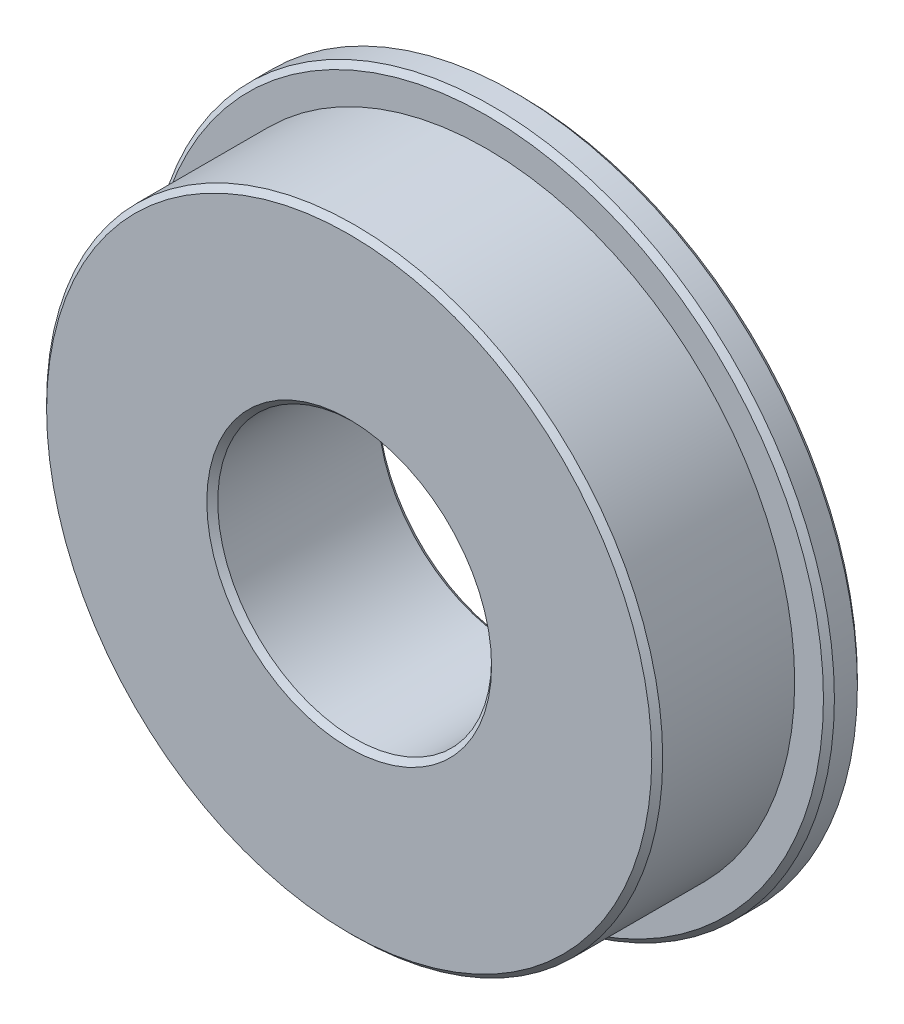
ISO-10303-21;
HEADER;
FILE_DESCRIPTION(('STEP AP214'),'2;1');
FILE_NAME('part.step','',(''),(''),'','','');
FILE_SCHEMA(('AUTOMOTIVE_DESIGN { 1 0 10303 214 1 1 1 1 }'));
ENDSEC;
DATA;
#1=APPLICATION_CONTEXT('core data for automotive mechanical design processes');
#2=APPLICATION_PROTOCOL_DEFINITION('international standard','automotive_design',2000,#1);
#3=PRODUCT_CONTEXT('',#1,'mechanical');
#4=PRODUCT('Part','Part','',(#3));
#5=PRODUCT_RELATED_PRODUCT_CATEGORY('part','',(#4));
#6=PRODUCT_DEFINITION_FORMATION('','',#4);
#7=PRODUCT_DEFINITION_CONTEXT('part definition',#1,'design');
#8=PRODUCT_DEFINITION('design','',#6,#7);
#9=PRODUCT_DEFINITION_SHAPE('','',#8);
#10=(LENGTH_UNIT() NAMED_UNIT(*) SI_UNIT(.MILLI.,.METRE.));
#11=(NAMED_UNIT(*) PLANE_ANGLE_UNIT() SI_UNIT($,.RADIAN.));
#12=(NAMED_UNIT(*) SI_UNIT($,.STERADIAN.) SOLID_ANGLE_UNIT());
#13=UNCERTAINTY_MEASURE_WITH_UNIT(LENGTH_MEASURE(1.E-05),#10,'distance_accuracy_value','');
#14=(GEOMETRIC_REPRESENTATION_CONTEXT(3) GLOBAL_UNCERTAINTY_ASSIGNED_CONTEXT((#13)) GLOBAL_UNIT_ASSIGNED_CONTEXT((#10,
#11,#12)) REPRESENTATION_CONTEXT('',''));
#15=CARTESIAN_POINT('',(0.,0.,0.));
#16=DIRECTION('',(0.,0.,1.));
#17=DIRECTION('',(1.,0.,0.));
#18=AXIS2_PLACEMENT_3D('',#15,#16,#17);
#19=CARTESIAN_POINT('',(-8.86153846153846,6.04195804195805,7.69619999999998));
#20=DIRECTION('',(0.,0.,-1.));
#21=DIRECTION('',(-1.,0.,0.));
#22=AXIS2_PLACEMENT_3D('',#19,#20,#21);
#23=CONICAL_SURFACE('',#22,14.2875,0.785398163397453);
#24=CARTESIAN_POINT('',(-8.86153846153846,6.04195804195805,7.95019999999999));
#25=DIRECTION('',(0.,0.,-1.));
#26=DIRECTION('',(-1.,0.,0.));
#27=AXIS2_PLACEMENT_3D('',#24,#25,#26);
#28=CIRCLE('',#27,14.0335);
#29=CARTESIAN_POINT('',(-22.8950384615385,6.04195804195805,7.95019999999999));
#30=VERTEX_POINT('',#29);
#31=EDGE_CURVE('E18',#30,#30,#28,.T.);
#32=ORIENTED_EDGE('',*,*,#31,.T.);
#33=EDGE_LOOP('',(#32));
#34=FACE_BOUND('',#33,.T.);
#35=CARTESIAN_POINT('',(-8.86153846153846,6.04195804195805,7.69619999999999));
#36=DIRECTION('',(0.,0.,1.));
#37=DIRECTION('',(1.,0.,0.));
#38=AXIS2_PLACEMENT_3D('',#35,#36,#37);
#39=CIRCLE('',#38,14.2875);
#40=CARTESIAN_POINT('',(5.42596153846154,6.04195804195805,7.69619999999999));
#41=VERTEX_POINT('',#40);
#42=EDGE_CURVE('E30',#41,#41,#39,.F.);
#43=ORIENTED_EDGE('',*,*,#42,.F.);
#44=EDGE_LOOP('',(#43));
#45=FACE_BOUND('',#44,.T.);
#46=ADVANCED_FACE('F15',(#34,#45),#23,.T.);
#47=CARTESIAN_POINT('',(-8.86153846153846,6.04195804195805,7.95019999999999));
#48=DIRECTION('',(0.,0.,1.));
#49=DIRECTION('',(1.,0.,0.));
#50=AXIS2_PLACEMENT_3D('',#47,#48,#49);
#51=CYLINDRICAL_SURFACE('',#50,14.2875);
#52=CARTESIAN_POINT('',(-8.86153846153846,6.04195804195805,1.57479999999999));
#53=DIRECTION('',(0.,0.,1.));
#54=DIRECTION('',(1.,0.,0.));
#55=AXIS2_PLACEMENT_3D('',#52,#53,#54);
#56=CIRCLE('',#55,14.2875);
#57=CARTESIAN_POINT('',(5.42596153846154,6.04195804195805,1.57479999999999));
#58=VERTEX_POINT('',#57);
#59=EDGE_CURVE('E39',#58,#58,#56,.T.);
#60=ORIENTED_EDGE('',*,*,#59,.T.);
#61=EDGE_LOOP('',(#60));
#62=FACE_BOUND('',#61,.T.);
#63=ORIENTED_EDGE('',*,*,#42,.T.);
#64=EDGE_LOOP('',(#63));
#65=FACE_BOUND('',#64,.T.);
#66=ADVANCED_FACE('F49',(#62,#65),#51,.T.);
#67=CARTESIAN_POINT('',(-8.86153846153846,6.04195804195805,7.95019999999999));
#68=DIRECTION('',(0.,0.,-1.));
#69=DIRECTION('',(-1.,0.,0.));
#70=AXIS2_PLACEMENT_3D('',#67,#68,#69);
#71=PLANE('',#70);
#72=ORIENTED_EDGE('',*,*,#31,.F.);
#73=EDGE_LOOP('',(#72));
#74=FACE_BOUND('',#73,.T.);
#75=CARTESIAN_POINT('',(-8.86153846153846,6.04195804195805,7.95019999998203));
#76=DIRECTION('',(0.,0.,1.));
#77=DIRECTION('',(1.,0.,0.));
#78=AXIS2_PLACEMENT_3D('',#75,#76,#77);
#79=CIRCLE('',#78,6.60399999993232);
#80=CARTESIAN_POINT('',(-2.25753846160615,6.04195804195805,7.95019999998203));
#81=VERTEX_POINT('',#80);
#82=EDGE_CURVE('E37',#81,#81,#79,.F.);
#83=ORIENTED_EDGE('',*,*,#82,.T.);
#84=EDGE_LOOP('',(#83));
#85=FACE_BOUND('',#84,.T.);
#86=ADVANCED_FACE('F56',(#74,#85),#71,.F.);
#87=CARTESIAN_POINT('',(-8.86153846153846,6.04195804195805,1.57479999999999));
#88=DIRECTION('',(0.,0.,-1.));
#89=DIRECTION('',(-1.,0.,0.));
#90=AXIS2_PLACEMENT_3D('',#87,#88,#89);
#91=PLANE('',#90);
#92=ORIENTED_EDGE('',*,*,#59,.F.);
#93=EDGE_LOOP('',(#92));
#94=FACE_BOUND('',#93,.T.);
#95=CARTESIAN_POINT('',(-8.86153846153846,6.04195804195805,1.5748));
#96=DIRECTION('',(0.,0.,-1.));
#97=DIRECTION('',(-1.,0.,0.));
#98=AXIS2_PLACEMENT_3D('',#95,#96,#97);
#99=CIRCLE('',#98,15.621);
#100=CARTESIAN_POINT('',(-24.4825384615385,6.04195804195805,1.5748));
#101=VERTEX_POINT('',#100);
#102=EDGE_CURVE('E33',#101,#101,#99,.T.);
#103=ORIENTED_EDGE('',*,*,#102,.F.);
#104=EDGE_LOOP('',(#103));
#105=FACE_BOUND('',#104,.T.);
#106=ADVANCED_FACE('F87',(#94,#105),#91,.F.);
#107=CARTESIAN_POINT('',(-8.86153846153846,6.04195804195805,7.95019999986835));
#108=DIRECTION('',(0.,0.,1.));
#109=DIRECTION('',(1.,0.,0.));
#110=AXIS2_PLACEMENT_3D('',#107,#108,#109);
#111=CONICAL_SURFACE('',#110,6.60399999981863,0.785398163285552);
#112=CARTESIAN_POINT('',(-8.86153846153846,6.04195804195805,7.69619999999999));
#113=DIRECTION('',(0.,0.,1.));
#114=DIRECTION('',(1.,0.,0.));
#115=AXIS2_PLACEMENT_3D('',#112,#113,#114);
#116=CIRCLE('',#115,6.35);
#117=CARTESIAN_POINT('',(-2.51153846153846,6.04195804195805,7.69619999999999));
#118=VERTEX_POINT('',#117);
#119=EDGE_CURVE('E36',#118,#118,#116,.F.);
#120=ORIENTED_EDGE('',*,*,#119,.T.);
#121=EDGE_LOOP('',(#120));
#122=FACE_BOUND('',#121,.T.);
#123=ORIENTED_EDGE('',*,*,#82,.F.);
#124=EDGE_LOOP('',(#123));
#125=FACE_BOUND('',#124,.T.);
#126=ADVANCED_FACE('F83',(#122,#125),#111,.F.);
#127=CARTESIAN_POINT('',(-8.86153846153846,6.04195804195805,1.32080000000001));
#128=DIRECTION('',(0.,0.,-1.));
#129=DIRECTION('',(-1.,0.,0.));
#130=AXIS2_PLACEMENT_3D('',#127,#128,#129);
#131=CONICAL_SURFACE('',#130,15.875,0.785398163397452);
#132=CARTESIAN_POINT('',(-8.86153846153846,6.04195804195805,1.32080000000001));
#133=DIRECTION('',(0.,0.,1.));
#134=DIRECTION('',(1.,0.,0.));
#135=AXIS2_PLACEMENT_3D('',#132,#133,#134);
#136=CIRCLE('',#135,15.875);
#137=CARTESIAN_POINT('',(7.01346153846154,6.04195804195805,1.32080000000001));
#138=VERTEX_POINT('',#137);
#139=EDGE_CURVE('E176',#138,#138,#136,.F.);
#140=ORIENTED_EDGE('',*,*,#139,.F.);
#141=EDGE_LOOP('',(#140));
#142=FACE_BOUND('',#141,.T.);
#143=ORIENTED_EDGE('',*,*,#102,.T.);
#144=EDGE_LOOP('',(#143));
#145=FACE_BOUND('',#144,.T.);
#146=ADVANCED_FACE('F79',(#142,#145),#131,.T.);
#147=CARTESIAN_POINT('',(-8.86153846153846,6.04195804195805,1.57479999999999));
#148=DIRECTION('',(0.,0.,1.));
#149=DIRECTION('',(1.,0.,0.));
#150=AXIS2_PLACEMENT_3D('',#147,#148,#149);
#151=CYLINDRICAL_SURFACE('',#150,6.35);
#152=ORIENTED_EDGE('',*,*,#119,.F.);
#153=EDGE_LOOP('',(#152));
#154=FACE_BOUND('',#153,.T.);
#155=CARTESIAN_POINT('',(-8.86153846153846,6.04195804195805,0.253999999927146));
#156=DIRECTION('',(0.,0.,-1.));
#157=DIRECTION('',(-1.,0.,0.));
#158=AXIS2_PLACEMENT_3D('',#155,#156,#157);
#159=CIRCLE('',#158,6.3499999999901);
#160=CARTESIAN_POINT('',(-15.2115384615286,6.04195804195805,0.253999999927146));
#161=VERTEX_POINT('',#160);
#162=EDGE_CURVE('E178',#161,#161,#159,.T.);
#163=ORIENTED_EDGE('',*,*,#162,.T.);
#164=EDGE_LOOP('',(#163));
#165=FACE_BOUND('',#164,.T.);
#166=ADVANCED_FACE('F75',(#154,#165),#151,.F.);
#167=CARTESIAN_POINT('',(-8.86153846153846,6.04195804195805,1.57479999999999));
#168=DIRECTION('',(0.,0.,1.));
#169=DIRECTION('',(1.,0.,0.));
#170=AXIS2_PLACEMENT_3D('',#167,#168,#169);
#171=CYLINDRICAL_SURFACE('',#170,15.875);
#172=CARTESIAN_POINT('',(-8.86153846153846,6.04195804195805,0.254000000000001));
#173=DIRECTION('',(0.,0.,1.));
#174=DIRECTION('',(1.,0.,0.));
#175=AXIS2_PLACEMENT_3D('',#172,#173,#174);
#176=CIRCLE('',#175,15.875);
#177=CARTESIAN_POINT('',(7.01346153846154,6.04195804195805,0.254000000000002));
#178=VERTEX_POINT('',#177);
#179=EDGE_CURVE('E27',#178,#178,#176,.F.);
#180=ORIENTED_EDGE('',*,*,#179,.F.);
#181=EDGE_LOOP('',(#180));
#182=FACE_BOUND('',#181,.T.);
#183=ORIENTED_EDGE('',*,*,#139,.T.);
#184=EDGE_LOOP('',(#183));
#185=FACE_BOUND('',#184,.T.);
#186=ADVANCED_FACE('F71',(#182,#185),#171,.T.);
#187=CARTESIAN_POINT('',(-8.86153846153846,6.04195804195805,-5.6843418860808E-11));
#188=DIRECTION('',(0.,0.,-1.));
#189=DIRECTION('',(-1.,0.,0.));
#190=AXIS2_PLACEMENT_3D('',#187,#188,#189);
#191=CONICAL_SURFACE('',#190,6.60399999997409,0.785398163397448);
#192=ORIENTED_EDGE('',*,*,#162,.F.);
#193=EDGE_LOOP('',(#192));
#194=FACE_BOUND('',#193,.T.);
#195=CARTESIAN_POINT('',(-8.86153846153846,6.04195804195805,-5.6843418860808E-11));
#196=DIRECTION('',(0.,0.,-1.));
#197=DIRECTION('',(-1.,0.,0.));
#198=AXIS2_PLACEMENT_3D('',#195,#196,#197);
#199=CIRCLE('',#198,6.60399999997409);
#200=CARTESIAN_POINT('',(-15.4655384615126,6.04195804195805,-5.6843418860808E-11));
#201=VERTEX_POINT('',#200);
#202=EDGE_CURVE('E22',#201,#201,#199,.F.);
#203=ORIENTED_EDGE('',*,*,#202,.F.);
#204=EDGE_LOOP('',(#203));
#205=FACE_BOUND('',#204,.T.);
#206=ADVANCED_FACE('F64',(#194,#205),#191,.F.);
#207=CARTESIAN_POINT('',(-8.86153846153846,6.04195804195805,0.254000000000001));
#208=DIRECTION('',(0.,0.,1.));
#209=DIRECTION('',(1.,0.,0.));
#210=AXIS2_PLACEMENT_3D('',#207,#208,#209);
#211=CONICAL_SURFACE('',#210,15.875,0.785398163397447);
#212=ORIENTED_EDGE('',*,*,#179,.T.);
#213=EDGE_LOOP('',(#212));
#214=FACE_BOUND('',#213,.T.);
#215=CARTESIAN_POINT('',(-8.86153846153846,6.04195804195805,0.));
#216=DIRECTION('',(0.,0.,1.));
#217=DIRECTION('',(1.,0.,0.));
#218=AXIS2_PLACEMENT_3D('',#215,#216,#217);
#219=CIRCLE('',#218,15.621);
#220=CARTESIAN_POINT('',(6.75946153846154,6.04195804195805,0.));
#221=VERTEX_POINT('',#220);
#222=EDGE_CURVE('E10',#221,#221,#219,.F.);
#223=ORIENTED_EDGE('',*,*,#222,.F.);
#224=EDGE_LOOP('',(#223));
#225=FACE_BOUND('',#224,.T.);
#226=ADVANCED_FACE('F59',(#214,#225),#211,.T.);
#227=CARTESIAN_POINT('',(-8.86153846153846,6.04195804195805,0.));
#228=DIRECTION('',(0.,0.,-1.));
#229=DIRECTION('',(-1.,0.,0.));
#230=AXIS2_PLACEMENT_3D('',#227,#228,#229);
#231=PLANE('',#230);
#232=ORIENTED_EDGE('',*,*,#222,.T.);
#233=EDGE_LOOP('',(#232));
#234=FACE_BOUND('',#233,.T.);
#235=ORIENTED_EDGE('',*,*,#202,.T.);
#236=EDGE_LOOP('',(#235));
#237=FACE_BOUND('',#236,.T.);
#238=ADVANCED_FACE('F57',(#234,#237),#231,.T.);
#239=CLOSED_SHELL('',(#46,#66,#86,#106,#126,#146,#166,#186,#206,#226,#238));
#240=MANIFOLD_SOLID_BREP('B1',#239);
#241=ADVANCED_BREP_SHAPE_REPRESENTATION('',(#18,#240),#14);
#242=SHAPE_DEFINITION_REPRESENTATION(#9,#241);
ENDSEC;
END-ISO-10303-21;
